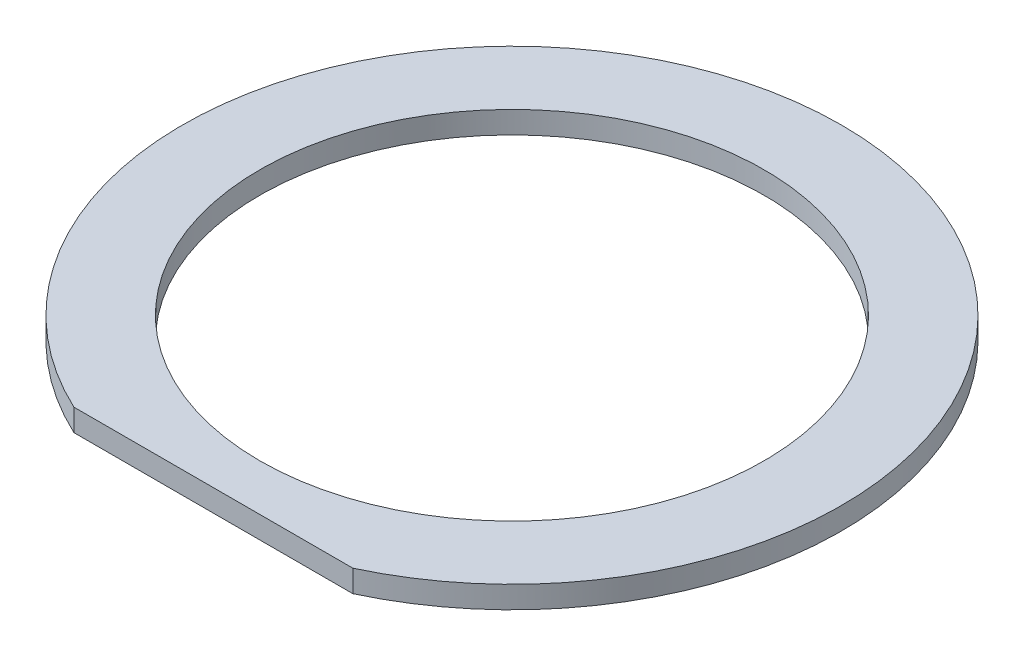
ISO-10303-21;
HEADER;
FILE_DESCRIPTION(('STEP AP214'),'2;1');
FILE_NAME('part.step','',(''),(''),'','','');
FILE_SCHEMA(('AUTOMOTIVE_DESIGN { 1 0 10303 214 1 1 1 1 }'));
ENDSEC;
DATA;
#1=APPLICATION_CONTEXT('core data for automotive mechanical design processes');
#2=APPLICATION_PROTOCOL_DEFINITION('international standard','automotive_design',2000,#1);
#3=PRODUCT_CONTEXT('',#1,'mechanical');
#4=PRODUCT('Part','Part','',(#3));
#5=PRODUCT_RELATED_PRODUCT_CATEGORY('part','',(#4));
#6=PRODUCT_DEFINITION_FORMATION('','',#4);
#7=PRODUCT_DEFINITION_CONTEXT('part definition',#1,'design');
#8=PRODUCT_DEFINITION('design','',#6,#7);
#9=PRODUCT_DEFINITION_SHAPE('','',#8);
#10=(LENGTH_UNIT() NAMED_UNIT(*) SI_UNIT(.MILLI.,.METRE.));
#11=(NAMED_UNIT(*) PLANE_ANGLE_UNIT() SI_UNIT($,.RADIAN.));
#12=(NAMED_UNIT(*) SI_UNIT($,.STERADIAN.) SOLID_ANGLE_UNIT());
#13=UNCERTAINTY_MEASURE_WITH_UNIT(LENGTH_MEASURE(1.E-05),#10,'distance_accuracy_value','');
#14=(GEOMETRIC_REPRESENTATION_CONTEXT(3) GLOBAL_UNCERTAINTY_ASSIGNED_CONTEXT((#13)) GLOBAL_UNIT_ASSIGNED_CONTEXT((#10,
#11,#12)) REPRESENTATION_CONTEXT('',''));
#15=CARTESIAN_POINT('',(0.,0.,0.));
#16=DIRECTION('',(0.,0.,1.));
#17=DIRECTION('',(1.,0.,0.));
#18=AXIS2_PLACEMENT_3D('',#15,#16,#17);
#19=CARTESIAN_POINT('',(0.,1.27,0.));
#20=DIRECTION('',(0.,1.,0.));
#21=DIRECTION('',(0.,0.,1.));
#22=AXIS2_PLACEMENT_3D('',#19,#20,#21);
#23=PLANE('',#22);
#24=CARTESIAN_POINT('',(0.,1.27,0.));
#25=DIRECTION('',(0.,1.,0.));
#26=DIRECTION('',(0.,0.,1.));
#27=AXIS2_PLACEMENT_3D('',#24,#25,#26);
#28=CIRCLE('',#27,18.923);
#29=CARTESIAN_POINT('',(8.0080524473807,1.27,17.145));
#30=VERTEX_POINT('',#29);
#31=CARTESIAN_POINT('',(-8.0080524473807,1.27,17.145));
#32=VERTEX_POINT('',#31);
#33=EDGE_CURVE('E70',#30,#32,#28,.T.);
#34=ORIENTED_EDGE('',*,*,#33,.T.);
#35=DIRECTION('',(1.,0.,0.));
#36=VECTOR('',#35,1.);
#37=CARTESIAN_POINT('',(-8.0080524473807,1.27,17.145));
#38=LINE('',#37,#36);
#39=EDGE_CURVE('E61',#32,#30,#38,.T.);
#40=ORIENTED_EDGE('',*,*,#39,.T.);
#41=EDGE_LOOP('',(#34,#40));
#42=FACE_BOUND('',#41,.T.);
#43=CARTESIAN_POINT('',(0.,1.27,0.));
#44=DIRECTION('',(0.,1.,0.));
#45=DIRECTION('',(0.,0.,1.));
#46=AXIS2_PLACEMENT_3D('',#43,#44,#45);
#47=CIRCLE('',#46,14.478);
#48=CARTESIAN_POINT('',(0.,1.27,14.478));
#49=VERTEX_POINT('',#48);
#50=EDGE_CURVE('E66',#49,#49,#47,.T.);
#51=ORIENTED_EDGE('',*,*,#50,.F.);
#52=EDGE_LOOP('',(#51));
#53=FACE_BOUND('',#52,.T.);
#54=ADVANCED_FACE('F34',(#42,#53),#23,.T.);
#55=CARTESIAN_POINT('',(0.,0.,0.));
#56=DIRECTION('',(0.,1.,0.));
#57=DIRECTION('',(0.,0.,1.));
#58=AXIS2_PLACEMENT_3D('',#55,#56,#57);
#59=PLANE('',#58);
#60=CARTESIAN_POINT('',(0.,0.,0.));
#61=DIRECTION('',(0.,1.,0.));
#62=DIRECTION('',(0.,0.,1.));
#63=AXIS2_PLACEMENT_3D('',#60,#61,#62);
#64=CIRCLE('',#63,18.923);
#65=CARTESIAN_POINT('',(8.0080524473807,0.,17.145));
#66=VERTEX_POINT('',#65);
#67=CARTESIAN_POINT('',(-8.0080524473807,0.,17.145));
#68=VERTEX_POINT('',#67);
#69=EDGE_CURVE('E63',#66,#68,#64,.T.);
#70=ORIENTED_EDGE('',*,*,#69,.F.);
#71=DIRECTION('',(1.,0.,0.));
#72=VECTOR('',#71,1.);
#73=CARTESIAN_POINT('',(-8.0080524473807,0.,17.145));
#74=LINE('',#73,#72);
#75=EDGE_CURVE('E59',#68,#66,#74,.T.);
#76=ORIENTED_EDGE('',*,*,#75,.F.);
#77=EDGE_LOOP('',(#70,#76));
#78=FACE_BOUND('',#77,.T.);
#79=CARTESIAN_POINT('',(0.,0.,0.));
#80=DIRECTION('',(0.,1.,0.));
#81=DIRECTION('',(0.,0.,1.));
#82=AXIS2_PLACEMENT_3D('',#79,#80,#81);
#83=CIRCLE('',#82,14.478);
#84=CARTESIAN_POINT('',(0.,0.,14.478));
#85=VERTEX_POINT('',#84);
#86=EDGE_CURVE('E83',#85,#85,#83,.T.);
#87=ORIENTED_EDGE('',*,*,#86,.T.);
#88=EDGE_LOOP('',(#87));
#89=FACE_BOUND('',#88,.T.);
#90=ADVANCED_FACE('F68',(#78,#89),#59,.F.);
#91=CARTESIAN_POINT('',(0.,1.27,0.));
#92=DIRECTION('',(0.,-1.,0.));
#93=DIRECTION('',(0.,0.,-1.));
#94=AXIS2_PLACEMENT_3D('',#91,#92,#93);
#95=CYLINDRICAL_SURFACE('',#94,18.923);
#96=DIRECTION('',(0.,-1.,0.));
#97=VECTOR('',#96,1.);
#98=CARTESIAN_POINT('',(-8.0080524473807,1.27,17.145));
#99=LINE('',#98,#97);
#100=EDGE_CURVE('E11',#32,#68,#99,.T.);
#101=ORIENTED_EDGE('',*,*,#100,.F.);
#102=ORIENTED_EDGE('',*,*,#33,.F.);
#103=DIRECTION('',(0.,-1.,0.));
#104=VECTOR('',#103,1.);
#105=CARTESIAN_POINT('',(8.0080524473807,1.27,17.145));
#106=LINE('',#105,#104);
#107=EDGE_CURVE('E42',#30,#66,#106,.T.);
#108=ORIENTED_EDGE('',*,*,#107,.T.);
#109=ORIENTED_EDGE('',*,*,#69,.T.);
#110=EDGE_LOOP('',(#101,#102,#108,#109));
#111=FACE_BOUND('',#110,.T.);
#112=ADVANCED_FACE('F64',(#111),#95,.T.);
#113=CARTESIAN_POINT('',(-8.0080524473807,1.27,17.145));
#114=DIRECTION('',(0.,0.,-1.));
#115=DIRECTION('',(-1.,0.,0.));
#116=AXIS2_PLACEMENT_3D('',#113,#114,#115);
#117=PLANE('',#116);
#118=ORIENTED_EDGE('',*,*,#39,.F.);
#119=ORIENTED_EDGE('',*,*,#100,.T.);
#120=ORIENTED_EDGE('',*,*,#75,.T.);
#121=ORIENTED_EDGE('',*,*,#107,.F.);
#122=EDGE_LOOP('',(#118,#119,#120,#121));
#123=FACE_BOUND('',#122,.T.);
#124=ADVANCED_FACE('F36',(#123),#117,.F.);
#125=CARTESIAN_POINT('',(0.,1.27,0.));
#126=DIRECTION('',(0.,-1.,0.));
#127=DIRECTION('',(0.,0.,-1.));
#128=AXIS2_PLACEMENT_3D('',#125,#126,#127);
#129=CYLINDRICAL_SURFACE('',#128,14.478);
#130=ORIENTED_EDGE('',*,*,#50,.T.);
#131=EDGE_LOOP('',(#130));
#132=FACE_BOUND('',#131,.T.);
#133=ORIENTED_EDGE('',*,*,#86,.F.);
#134=EDGE_LOOP('',(#133));
#135=FACE_BOUND('',#134,.T.);
#136=ADVANCED_FACE('F87',(#132,#135),#129,.F.);
#137=CLOSED_SHELL('',(#54,#90,#112,#124,#136));
#138=MANIFOLD_SOLID_BREP('B2',#137);
#139=ADVANCED_BREP_SHAPE_REPRESENTATION('',(#18,#138),#14);
#140=SHAPE_DEFINITION_REPRESENTATION(#9,#139);
ENDSEC;
END-ISO-10303-21;
